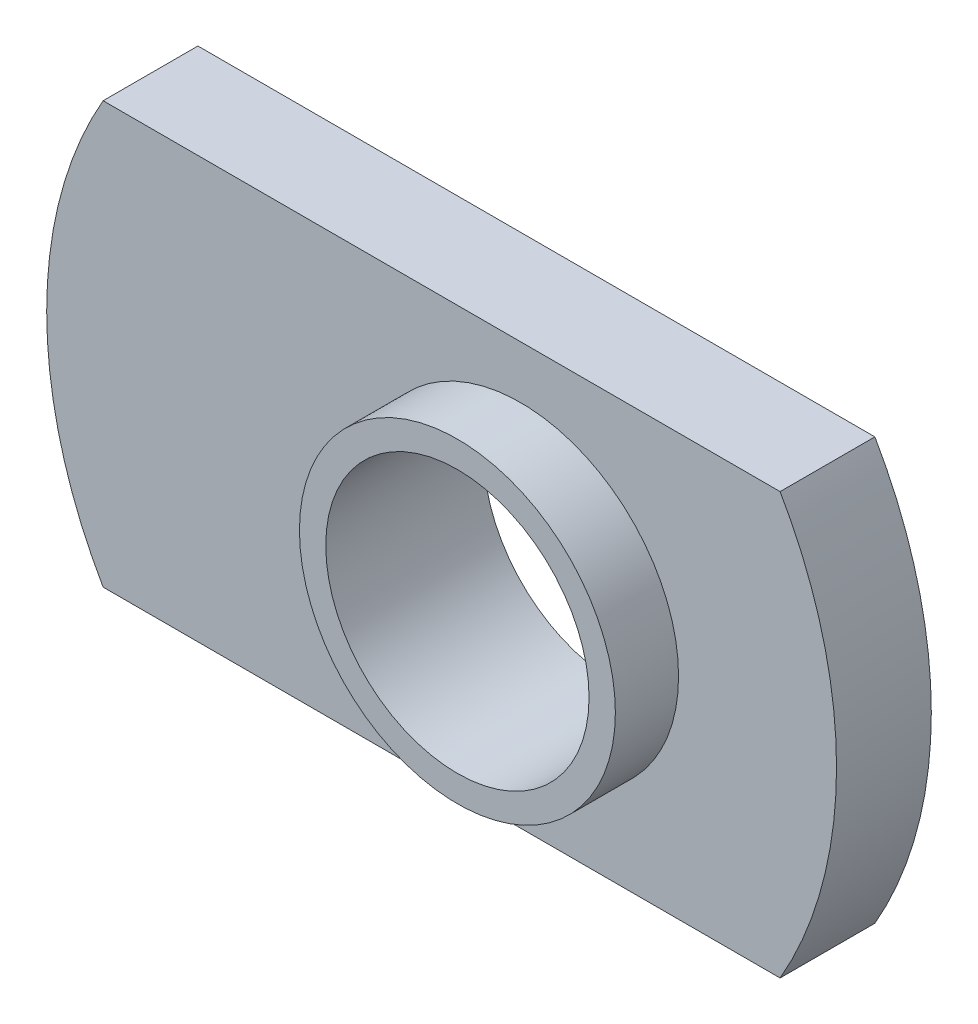
ISO-10303-21;
HEADER;
FILE_DESCRIPTION(('STEP AP214'),'2;1');
FILE_NAME('part.step','',(''),(''),'','','');
FILE_SCHEMA(('AUTOMOTIVE_DESIGN { 1 0 10303 214 1 1 1 1 }'));
ENDSEC;
DATA;
#1=APPLICATION_CONTEXT('core data for automotive mechanical design processes');
#2=APPLICATION_PROTOCOL_DEFINITION('international standard','automotive_design',2000,#1);
#3=PRODUCT_CONTEXT('',#1,'mechanical');
#4=PRODUCT('Part','Part','',(#3));
#5=PRODUCT_RELATED_PRODUCT_CATEGORY('part','',(#4));
#6=PRODUCT_DEFINITION_FORMATION('','',#4);
#7=PRODUCT_DEFINITION_CONTEXT('part definition',#1,'design');
#8=PRODUCT_DEFINITION('design','',#6,#7);
#9=PRODUCT_DEFINITION_SHAPE('','',#8);
#10=(LENGTH_UNIT() NAMED_UNIT(*) SI_UNIT(.MILLI.,.METRE.));
#11=(NAMED_UNIT(*) PLANE_ANGLE_UNIT() SI_UNIT($,.RADIAN.));
#12=(NAMED_UNIT(*) SI_UNIT($,.STERADIAN.) SOLID_ANGLE_UNIT());
#13=UNCERTAINTY_MEASURE_WITH_UNIT(LENGTH_MEASURE(1.E-05),#10,'distance_accuracy_value','');
#14=(GEOMETRIC_REPRESENTATION_CONTEXT(3) GLOBAL_UNCERTAINTY_ASSIGNED_CONTEXT((#13)) GLOBAL_UNIT_ASSIGNED_CONTEXT((#10,
#11,#12)) REPRESENTATION_CONTEXT('',''));
#15=CARTESIAN_POINT('',(0.,0.,0.));
#16=DIRECTION('',(0.,0.,1.));
#17=DIRECTION('',(1.,0.,0.));
#18=AXIS2_PLACEMENT_3D('',#15,#16,#17);
#19=CARTESIAN_POINT('',(-1.,0.,0.9));
#20=DIRECTION('',(0.,0.,-1.));
#21=DIRECTION('',(-1.,0.,0.));
#22=AXIS2_PLACEMENT_3D('',#19,#20,#21);
#23=CYLINDRICAL_SURFACE('',#22,8.);
#24=CARTESIAN_POINT('',(-1.,0.,-0.9));
#25=DIRECTION('',(0.,0.,1.));
#26=DIRECTION('',(-1.,0.,0.));
#27=AXIS2_PLACEMENT_3D('',#24,#25,#26);
#28=CIRCLE('',#27,8.);
#29=CARTESIAN_POINT('',(-7.92820323027551,4.,-0.9));
#30=VERTEX_POINT('',#29);
#31=CARTESIAN_POINT('',(-7.92820323027551,-4.,-0.9));
#32=VERTEX_POINT('',#31);
#33=EDGE_CURVE('E102',#30,#32,#28,.T.);
#34=ORIENTED_EDGE('',*,*,#33,.T.);
#35=DIRECTION('',(0.,0.,-1.));
#36=VECTOR('',#35,1.);
#37=CARTESIAN_POINT('',(-7.92820323027551,-4.,0.9));
#38=LINE('',#37,#36);
#39=CARTESIAN_POINT('',(-7.92820323027551,-4.,0.9));
#40=VERTEX_POINT('',#39);
#41=EDGE_CURVE('E44',#40,#32,#38,.T.);
#42=ORIENTED_EDGE('',*,*,#41,.F.);
#43=CARTESIAN_POINT('',(-1.,0.,0.9));
#44=DIRECTION('',(0.,0.,1.));
#45=DIRECTION('',(-1.,0.,0.));
#46=AXIS2_PLACEMENT_3D('',#43,#44,#45);
#47=CIRCLE('',#46,8.);
#48=CARTESIAN_POINT('',(-7.92820323027551,4.,0.9));
#49=VERTEX_POINT('',#48);
#50=EDGE_CURVE('E88',#49,#40,#47,.T.);
#51=ORIENTED_EDGE('',*,*,#50,.F.);
#52=DIRECTION('',(0.,0.,-1.));
#53=VECTOR('',#52,1.);
#54=CARTESIAN_POINT('',(-7.92820323027551,4.,0.9));
#55=LINE('',#54,#53);
#56=EDGE_CURVE('E98',#49,#30,#55,.T.);
#57=ORIENTED_EDGE('',*,*,#56,.T.);
#58=EDGE_LOOP('',(#34,#42,#51,#57));
#59=FACE_BOUND('',#58,.T.);
#60=ADVANCED_FACE('F36',(#59),#23,.T.);
#61=CARTESIAN_POINT('',(-7.92820323027551,-4.,0.9));
#62=DIRECTION('',(0.,1.,0.));
#63=DIRECTION('',(-1.,0.,0.));
#64=AXIS2_PLACEMENT_3D('',#61,#62,#63);
#65=PLANE('',#64);
#66=DIRECTION('',(1.,0.,0.));
#67=VECTOR('',#66,1.);
#68=CARTESIAN_POINT('',(-7.92820323027551,-4.,-0.9));
#69=LINE('',#68,#67);
#70=CARTESIAN_POINT('',(4.92820323027551,-4.,-0.9));
#71=VERTEX_POINT('',#70);
#72=EDGE_CURVE('E93',#32,#71,#69,.T.);
#73=ORIENTED_EDGE('',*,*,#72,.T.);
#74=DIRECTION('',(0.,0.,-1.));
#75=VECTOR('',#74,1.);
#76=CARTESIAN_POINT('',(4.92820323027551,-4.,0.9));
#77=LINE('',#76,#75);
#78=CARTESIAN_POINT('',(4.92820323027551,-4.,0.9));
#79=VERTEX_POINT('',#78);
#80=EDGE_CURVE('E91',#79,#71,#77,.T.);
#81=ORIENTED_EDGE('',*,*,#80,.F.);
#82=DIRECTION('',(1.,0.,0.));
#83=VECTOR('',#82,1.);
#84=CARTESIAN_POINT('',(-7.92820323027551,-4.,0.9));
#85=LINE('',#84,#83);
#86=EDGE_CURVE('E83',#40,#79,#85,.T.);
#87=ORIENTED_EDGE('',*,*,#86,.F.);
#88=ORIENTED_EDGE('',*,*,#41,.T.);
#89=EDGE_LOOP('',(#73,#81,#87,#88));
#90=FACE_BOUND('',#89,.T.);
#91=ADVANCED_FACE('F92',(#90),#65,.F.);
#92=CARTESIAN_POINT('',(-2.,0.,0.9));
#93=DIRECTION('',(0.,0.,-1.));
#94=DIRECTION('',(-1.,0.,0.));
#95=AXIS2_PLACEMENT_3D('',#92,#93,#94);
#96=CYLINDRICAL_SURFACE('',#95,8.);
#97=CARTESIAN_POINT('',(-2.,0.,-0.9));
#98=DIRECTION('',(0.,0.,1.));
#99=DIRECTION('',(1.,0.,0.));
#100=AXIS2_PLACEMENT_3D('',#97,#98,#99);
#101=CIRCLE('',#100,8.);
#102=CARTESIAN_POINT('',(4.92820323027551,4.,-0.9));
#103=VERTEX_POINT('',#102);
#104=EDGE_CURVE('E69',#71,#103,#101,.T.);
#105=ORIENTED_EDGE('',*,*,#104,.T.);
#106=DIRECTION('',(0.,0.,-1.));
#107=VECTOR('',#106,1.);
#108=CARTESIAN_POINT('',(4.92820323027551,4.,0.9));
#109=LINE('',#108,#107);
#110=CARTESIAN_POINT('',(4.92820323027551,4.,0.9));
#111=VERTEX_POINT('',#110);
#112=EDGE_CURVE('E94',#111,#103,#109,.T.);
#113=ORIENTED_EDGE('',*,*,#112,.F.);
#114=CARTESIAN_POINT('',(-2.,0.,0.9));
#115=DIRECTION('',(0.,0.,1.));
#116=DIRECTION('',(1.,0.,0.));
#117=AXIS2_PLACEMENT_3D('',#114,#115,#116);
#118=CIRCLE('',#117,8.);
#119=EDGE_CURVE('E86',#79,#111,#118,.T.);
#120=ORIENTED_EDGE('',*,*,#119,.F.);
#121=ORIENTED_EDGE('',*,*,#80,.T.);
#122=EDGE_LOOP('',(#105,#113,#120,#121));
#123=FACE_BOUND('',#122,.T.);
#124=ADVANCED_FACE('F96',(#123),#96,.T.);
#125=CARTESIAN_POINT('',(-7.92820323027551,4.,0.9));
#126=DIRECTION('',(0.,-1.,0.));
#127=DIRECTION('',(0.,0.,-1.));
#128=AXIS2_PLACEMENT_3D('',#125,#126,#127);
#129=PLANE('',#128);
#130=DIRECTION('',(-1.,0.,0.));
#131=VECTOR('',#130,1.);
#132=CARTESIAN_POINT('',(-7.92820323027551,4.,-0.9));
#133=LINE('',#132,#131);
#134=EDGE_CURVE('E75',#103,#30,#133,.T.);
#135=ORIENTED_EDGE('',*,*,#134,.T.);
#136=ORIENTED_EDGE('',*,*,#56,.F.);
#137=DIRECTION('',(-1.,0.,0.));
#138=VECTOR('',#137,1.);
#139=CARTESIAN_POINT('',(-7.92820323027551,4.,0.9));
#140=LINE('',#139,#138);
#141=EDGE_CURVE('E52',#111,#49,#140,.T.);
#142=ORIENTED_EDGE('',*,*,#141,.F.);
#143=ORIENTED_EDGE('',*,*,#112,.T.);
#144=EDGE_LOOP('',(#135,#136,#142,#143));
#145=FACE_BOUND('',#144,.T.);
#146=ADVANCED_FACE('F125',(#145),#129,.F.);
#147=CARTESIAN_POINT('',(-1.,0.,0.9));
#148=DIRECTION('',(0.,0.,-1.));
#149=DIRECTION('',(-1.,0.,0.));
#150=AXIS2_PLACEMENT_3D('',#147,#148,#149);
#151=PLANE('',#150);
#152=CARTESIAN_POINT('',(0.,0.,0.9));
#153=DIRECTION('',(0.,0.,-1.));
#154=DIRECTION('',(-1.,0.,0.));
#155=AXIS2_PLACEMENT_3D('',#152,#153,#154);
#156=CIRCLE('',#155,3.);
#157=CARTESIAN_POINT('',(-3.,0.,0.9));
#158=VERTEX_POINT('',#157);
#159=EDGE_CURVE('E11',#158,#158,#156,.F.);
#160=ORIENTED_EDGE('',*,*,#159,.F.);
#161=EDGE_LOOP('',(#160));
#162=FACE_BOUND('',#161,.T.);
#163=ORIENTED_EDGE('',*,*,#50,.T.);
#164=ORIENTED_EDGE('',*,*,#86,.T.);
#165=ORIENTED_EDGE('',*,*,#119,.T.);
#166=ORIENTED_EDGE('',*,*,#141,.T.);
#167=EDGE_LOOP('',(#163,#164,#165,#166));
#168=FACE_BOUND('',#167,.T.);
#169=ADVANCED_FACE('F84',(#162,#168),#151,.F.);
#170=CARTESIAN_POINT('',(-1.,0.,-0.9));
#171=DIRECTION('',(0.,0.,-1.));
#172=DIRECTION('',(-1.,0.,0.));
#173=AXIS2_PLACEMENT_3D('',#170,#171,#172);
#174=PLANE('',#173);
#175=CARTESIAN_POINT('',(0.,0.,-0.9));
#176=DIRECTION('',(0.,0.,1.));
#177=DIRECTION('',(1.,0.,0.));
#178=AXIS2_PLACEMENT_3D('',#175,#176,#177);
#179=CIRCLE('',#178,2.5);
#180=CARTESIAN_POINT('',(2.5,0.,-0.9));
#181=VERTEX_POINT('',#180);
#182=EDGE_CURVE('E188',#181,#181,#179,.T.);
#183=ORIENTED_EDGE('',*,*,#182,.T.);
#184=EDGE_LOOP('',(#183));
#185=FACE_BOUND('',#184,.T.);
#186=ORIENTED_EDGE('',*,*,#33,.F.);
#187=ORIENTED_EDGE('',*,*,#134,.F.);
#188=ORIENTED_EDGE('',*,*,#104,.F.);
#189=ORIENTED_EDGE('',*,*,#72,.F.);
#190=EDGE_LOOP('',(#186,#187,#188,#189));
#191=FACE_BOUND('',#190,.T.);
#192=ADVANCED_FACE('F113',(#185,#191),#174,.T.);
#193=CARTESIAN_POINT('',(0.,0.,2.1));
#194=DIRECTION('',(0.,0.,1.));
#195=DIRECTION('',(1.,0.,0.));
#196=AXIS2_PLACEMENT_3D('',#193,#194,#195);
#197=PLANE('',#196);
#198=CARTESIAN_POINT('',(0.,0.,2.1));
#199=DIRECTION('',(0.,0.,1.));
#200=DIRECTION('',(1.,0.,0.));
#201=AXIS2_PLACEMENT_3D('',#198,#199,#200);
#202=CIRCLE('',#201,3.);
#203=CARTESIAN_POINT('',(3.,0.,2.1));
#204=VERTEX_POINT('',#203);
#205=EDGE_CURVE('E105',#204,#204,#202,.T.);
#206=ORIENTED_EDGE('',*,*,#205,.T.);
#207=EDGE_LOOP('',(#206));
#208=FACE_BOUND('',#207,.T.);
#209=CARTESIAN_POINT('',(0.,0.,2.1));
#210=DIRECTION('',(0.,0.,1.));
#211=DIRECTION('',(1.,0.,0.));
#212=AXIS2_PLACEMENT_3D('',#209,#210,#211);
#213=CIRCLE('',#212,2.5);
#214=CARTESIAN_POINT('',(2.5,0.,2.1));
#215=VERTEX_POINT('',#214);
#216=EDGE_CURVE('E186',#215,#215,#213,.T.);
#217=ORIENTED_EDGE('',*,*,#216,.F.);
#218=EDGE_LOOP('',(#217));
#219=FACE_BOUND('',#218,.T.);
#220=ADVANCED_FACE('F115',(#208,#219),#197,.T.);
#221=CARTESIAN_POINT('',(0.,0.,2.1));
#222=DIRECTION('',(0.,0.,-1.));
#223=DIRECTION('',(-1.,0.,0.));
#224=AXIS2_PLACEMENT_3D('',#221,#222,#223);
#225=CYLINDRICAL_SURFACE('',#224,3.);
#226=ORIENTED_EDGE('',*,*,#205,.F.);
#227=EDGE_LOOP('',(#226));
#228=FACE_BOUND('',#227,.T.);
#229=ORIENTED_EDGE('',*,*,#159,.T.);
#230=EDGE_LOOP('',(#229));
#231=FACE_BOUND('',#230,.T.);
#232=ADVANCED_FACE('F122',(#228,#231),#225,.T.);
#233=CARTESIAN_POINT('',(0.,0.,2.1));
#234=DIRECTION('',(0.,0.,-1.));
#235=DIRECTION('',(-1.,0.,0.));
#236=AXIS2_PLACEMENT_3D('',#233,#234,#235);
#237=CYLINDRICAL_SURFACE('',#236,2.5);
#238=ORIENTED_EDGE('',*,*,#216,.T.);
#239=EDGE_LOOP('',(#238));
#240=FACE_BOUND('',#239,.T.);
#241=ORIENTED_EDGE('',*,*,#182,.F.);
#242=EDGE_LOOP('',(#241));
#243=FACE_BOUND('',#242,.T.);
#244=ADVANCED_FACE('F162',(#240,#243),#237,.F.);
#245=CLOSED_SHELL('',(#60,#91,#124,#146,#169,#192,#220,#232,#244));
#246=MANIFOLD_SOLID_BREP('B2',#245);
#247=ADVANCED_BREP_SHAPE_REPRESENTATION('',(#18,#246),#14);
#248=SHAPE_DEFINITION_REPRESENTATION(#9,#247);
ENDSEC;
END-ISO-10303-21;
